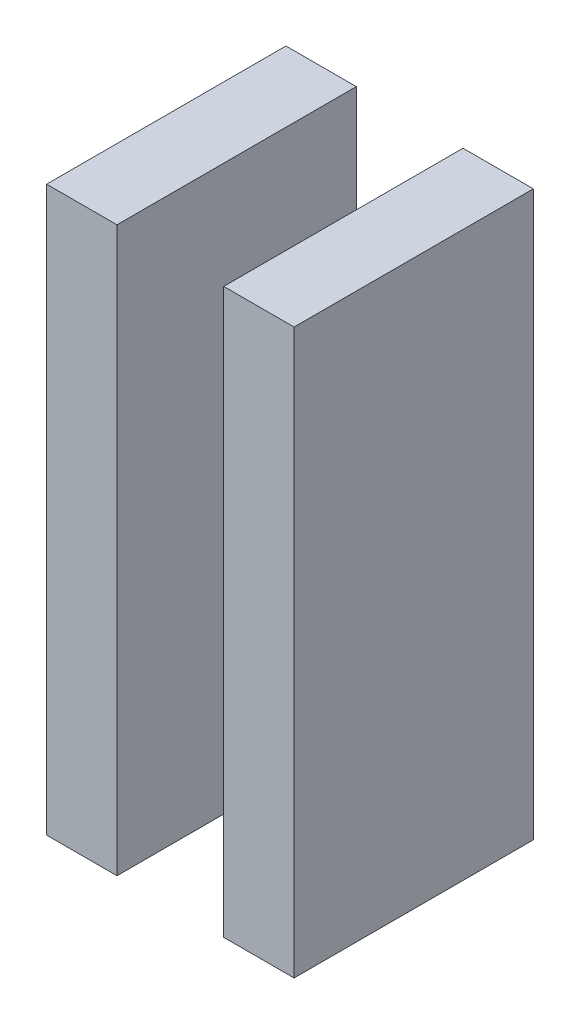
ISO-10303-21;
HEADER;
FILE_DESCRIPTION(('STEP AP214'),'2;1');
FILE_NAME('part.step','',(''),(''),'','','');
FILE_SCHEMA(('AUTOMOTIVE_DESIGN { 1 0 10303 214 1 1 1 1 }'));
ENDSEC;
DATA;
#1=APPLICATION_CONTEXT('core data for automotive mechanical design processes');
#2=APPLICATION_PROTOCOL_DEFINITION('international standard','automotive_design',2000,#1);
#3=PRODUCT_CONTEXT('',#1,'mechanical');
#4=PRODUCT('Part','Part','',(#3));
#5=PRODUCT_RELATED_PRODUCT_CATEGORY('part','',(#4));
#6=PRODUCT_DEFINITION_FORMATION('','',#4);
#7=PRODUCT_DEFINITION_CONTEXT('part definition',#1,'design');
#8=PRODUCT_DEFINITION('design','',#6,#7);
#9=PRODUCT_DEFINITION_SHAPE('','',#8);
#10=(LENGTH_UNIT() NAMED_UNIT(*) SI_UNIT(.MILLI.,.METRE.));
#11=(NAMED_UNIT(*) PLANE_ANGLE_UNIT() SI_UNIT($,.RADIAN.));
#12=(NAMED_UNIT(*) SI_UNIT($,.STERADIAN.) SOLID_ANGLE_UNIT());
#13=UNCERTAINTY_MEASURE_WITH_UNIT(LENGTH_MEASURE(1.E-05),#10,'distance_accuracy_value','');
#14=(GEOMETRIC_REPRESENTATION_CONTEXT(3) GLOBAL_UNCERTAINTY_ASSIGNED_CONTEXT((#13)) GLOBAL_UNIT_ASSIGNED_CONTEXT((#10,
#11,#12)) REPRESENTATION_CONTEXT('',''));
#15=CARTESIAN_POINT('',(0.,0.,0.));
#16=DIRECTION('',(0.,0.,1.));
#17=DIRECTION('',(1.,0.,0.));
#18=AXIS2_PLACEMENT_3D('',#15,#16,#17);
#19=CARTESIAN_POINT('',(158.1725,-54.445,11.));
#20=DIRECTION('',(0.,-1.,0.));
#21=DIRECTION('',(0.,0.,-1.));
#22=AXIS2_PLACEMENT_3D('',#19,#20,#21);
#23=PLANE('',#22);
#24=DIRECTION('',(-1.,0.,0.));
#25=VECTOR('',#24,1.);
#26=CARTESIAN_POINT('',(158.1725,-54.445,1.));
#27=LINE('',#26,#25);
#28=CARTESIAN_POINT('',(158.1725,-54.445,1.));
#29=VERTEX_POINT('',#28);
#30=CARTESIAN_POINT('',(155.2325,-54.445,1.));
#31=VERTEX_POINT('',#30);
#32=EDGE_CURVE('E12',#29,#31,#27,.T.);
#33=ORIENTED_EDGE('',*,*,#32,.T.);
#34=DIRECTION('',(0.,0.,-1.));
#35=VECTOR('',#34,1.);
#36=CARTESIAN_POINT('',(155.2325,-54.445,11.));
#37=LINE('',#36,#35);
#38=CARTESIAN_POINT('',(155.2325,-54.445,11.));
#39=VERTEX_POINT('',#38);
#40=EDGE_CURVE('E118',#39,#31,#37,.T.);
#41=ORIENTED_EDGE('',*,*,#40,.F.);
#42=DIRECTION('',(-1.,0.,0.));
#43=VECTOR('',#42,1.);
#44=CARTESIAN_POINT('',(158.1725,-54.445,11.));
#45=LINE('',#44,#43);
#46=CARTESIAN_POINT('',(158.1725,-54.445,11.));
#47=VERTEX_POINT('',#46);
#48=EDGE_CURVE('E51',#47,#39,#45,.T.);
#49=ORIENTED_EDGE('',*,*,#48,.F.);
#50=DIRECTION('',(0.,0.,-1.));
#51=VECTOR('',#50,1.);
#52=CARTESIAN_POINT('',(158.1725,-54.445,11.));
#53=LINE('',#52,#51);
#54=EDGE_CURVE('E106',#47,#29,#53,.T.);
#55=ORIENTED_EDGE('',*,*,#54,.T.);
#56=EDGE_LOOP('',(#33,#41,#49,#55));
#57=FACE_BOUND('',#56,.T.);
#58=ADVANCED_FACE('F47',(#57),#23,.F.);
#59=CARTESIAN_POINT('',(155.2325,-54.445,11.));
#60=DIRECTION('',(1.,0.,0.));
#61=DIRECTION('',(0.,0.,-1.));
#62=AXIS2_PLACEMENT_3D('',#59,#60,#61);
#63=PLANE('',#62);
#64=DIRECTION('',(0.,-1.,0.));
#65=VECTOR('',#64,1.);
#66=CARTESIAN_POINT('',(155.2325,-54.445,1.));
#67=LINE('',#66,#65);
#68=CARTESIAN_POINT('',(155.2325,-78.005,1.));
#69=VERTEX_POINT('',#68);
#70=EDGE_CURVE('E57',#31,#69,#67,.T.);
#71=ORIENTED_EDGE('',*,*,#70,.T.);
#72=DIRECTION('',(0.,0.,-1.));
#73=VECTOR('',#72,1.);
#74=CARTESIAN_POINT('',(155.2325,-78.005,11.));
#75=LINE('',#74,#73);
#76=CARTESIAN_POINT('',(155.2325,-78.005,11.));
#77=VERTEX_POINT('',#76);
#78=EDGE_CURVE('E102',#77,#69,#75,.T.);
#79=ORIENTED_EDGE('',*,*,#78,.F.);
#80=DIRECTION('',(0.,-1.,0.));
#81=VECTOR('',#80,1.);
#82=CARTESIAN_POINT('',(155.2325,-54.445,11.));
#83=LINE('',#82,#81);
#84=EDGE_CURVE('E81',#39,#77,#83,.T.);
#85=ORIENTED_EDGE('',*,*,#84,.F.);
#86=ORIENTED_EDGE('',*,*,#40,.T.);
#87=EDGE_LOOP('',(#71,#79,#85,#86));
#88=FACE_BOUND('',#87,.T.);
#89=ADVANCED_FACE('F121',(#88),#63,.F.);
#90=CARTESIAN_POINT('',(158.1725,-78.005,11.));
#91=DIRECTION('',(0.,1.,0.));
#92=DIRECTION('',(0.,0.,1.));
#93=AXIS2_PLACEMENT_3D('',#90,#91,#92);
#94=PLANE('',#93);
#95=DIRECTION('',(1.,0.,0.));
#96=VECTOR('',#95,1.);
#97=CARTESIAN_POINT('',(158.1725,-78.005,1.));
#98=LINE('',#97,#96);
#99=CARTESIAN_POINT('',(158.1725,-78.005,1.));
#100=VERTEX_POINT('',#99);
#101=EDGE_CURVE('E97',#69,#100,#98,.T.);
#102=ORIENTED_EDGE('',*,*,#101,.T.);
#103=DIRECTION('',(0.,0.,-1.));
#104=VECTOR('',#103,1.);
#105=CARTESIAN_POINT('',(158.1725,-78.005,11.));
#106=LINE('',#105,#104);
#107=CARTESIAN_POINT('',(158.1725,-78.005,11.));
#108=VERTEX_POINT('',#107);
#109=EDGE_CURVE('E100',#108,#100,#106,.T.);
#110=ORIENTED_EDGE('',*,*,#109,.F.);
#111=DIRECTION('',(1.,0.,0.));
#112=VECTOR('',#111,1.);
#113=CARTESIAN_POINT('',(158.1725,-78.005,11.));
#114=LINE('',#113,#112);
#115=EDGE_CURVE('E114',#77,#108,#114,.T.);
#116=ORIENTED_EDGE('',*,*,#115,.F.);
#117=ORIENTED_EDGE('',*,*,#78,.T.);
#118=EDGE_LOOP('',(#102,#110,#116,#117));
#119=FACE_BOUND('',#118,.T.);
#120=ADVANCED_FACE('F98',(#119),#94,.F.);
#121=CARTESIAN_POINT('',(158.1725,-54.445,11.));
#122=DIRECTION('',(-1.,0.,0.));
#123=DIRECTION('',(0.,0.,1.));
#124=AXIS2_PLACEMENT_3D('',#121,#122,#123);
#125=PLANE('',#124);
#126=DIRECTION('',(0.,1.,0.));
#127=VECTOR('',#126,1.);
#128=CARTESIAN_POINT('',(158.1725,-54.445,1.));
#129=LINE('',#128,#127);
#130=EDGE_CURVE('E91',#100,#29,#129,.T.);
#131=ORIENTED_EDGE('',*,*,#130,.T.);
#132=ORIENTED_EDGE('',*,*,#54,.F.);
#133=DIRECTION('',(0.,1.,0.));
#134=VECTOR('',#133,1.);
#135=CARTESIAN_POINT('',(158.1725,-54.445,11.));
#136=LINE('',#135,#134);
#137=EDGE_CURVE('E105',#108,#47,#136,.T.);
#138=ORIENTED_EDGE('',*,*,#137,.F.);
#139=ORIENTED_EDGE('',*,*,#109,.T.);
#140=EDGE_LOOP('',(#131,#132,#138,#139));
#141=FACE_BOUND('',#140,.T.);
#142=ADVANCED_FACE('F104',(#141),#125,.F.);
#143=CARTESIAN_POINT('',(0.,0.,11.));
#144=DIRECTION('',(0.,0.,1.));
#145=DIRECTION('',(1.,0.,0.));
#146=AXIS2_PLACEMENT_3D('',#143,#144,#145);
#147=PLANE('',#146);
#148=ORIENTED_EDGE('',*,*,#48,.T.);
#149=ORIENTED_EDGE('',*,*,#84,.T.);
#150=ORIENTED_EDGE('',*,*,#115,.T.);
#151=ORIENTED_EDGE('',*,*,#137,.T.);
#152=EDGE_LOOP('',(#148,#149,#150,#151));
#153=FACE_BOUND('',#152,.T.);
#154=ADVANCED_FACE('F49',(#153),#147,.T.);
#155=CARTESIAN_POINT('',(0.,0.,1.));
#156=DIRECTION('',(0.,0.,1.));
#157=DIRECTION('',(1.,0.,0.));
#158=AXIS2_PLACEMENT_3D('',#155,#156,#157);
#159=PLANE('',#158);
#160=ORIENTED_EDGE('',*,*,#32,.F.);
#161=ORIENTED_EDGE('',*,*,#130,.F.);
#162=ORIENTED_EDGE('',*,*,#101,.F.);
#163=ORIENTED_EDGE('',*,*,#70,.F.);
#164=EDGE_LOOP('',(#160,#161,#162,#163));
#165=FACE_BOUND('',#164,.T.);
#166=ADVANCED_FACE('F108',(#165),#159,.F.);
#167=CLOSED_SHELL('',(#58,#89,#120,#142,#154,#166));
#168=MANIFOLD_SOLID_BREP('B2',#167);
#169=CARTESIAN_POINT('',(147.8325,-54.445,11.));
#170=DIRECTION('',(1.,0.,0.));
#171=DIRECTION('',(0.,0.,-1.));
#172=AXIS2_PLACEMENT_3D('',#169,#170,#171);
#173=PLANE('',#172);
#174=DIRECTION('',(0.,-1.,0.));
#175=VECTOR('',#174,1.);
#176=CARTESIAN_POINT('',(147.8325,-54.445,1.));
#177=LINE('',#176,#175);
#178=CARTESIAN_POINT('',(147.8325,-54.445,1.));
#179=VERTEX_POINT('',#178);
#180=CARTESIAN_POINT('',(147.8325,-78.005,1.));
#181=VERTEX_POINT('',#180);
#182=EDGE_CURVE('E246',#179,#181,#177,.T.);
#183=ORIENTED_EDGE('',*,*,#182,.T.);
#184=DIRECTION('',(0.,0.,-1.));
#185=VECTOR('',#184,1.);
#186=CARTESIAN_POINT('',(147.8325,-78.005,11.));
#187=LINE('',#186,#185);
#188=CARTESIAN_POINT('',(147.8325,-78.005,11.));
#189=VERTEX_POINT('',#188);
#190=EDGE_CURVE('E45',#189,#181,#187,.T.);
#191=ORIENTED_EDGE('',*,*,#190,.F.);
#192=DIRECTION('',(0.,-1.,0.));
#193=VECTOR('',#192,1.);
#194=CARTESIAN_POINT('',(147.8325,-54.445,11.));
#195=LINE('',#194,#193);
#196=CARTESIAN_POINT('',(147.8325,-54.445,11.));
#197=VERTEX_POINT('',#196);
#198=EDGE_CURVE('E234',#197,#189,#195,.T.);
#199=ORIENTED_EDGE('',*,*,#198,.F.);
#200=DIRECTION('',(0.,0.,-1.));
#201=VECTOR('',#200,1.);
#202=CARTESIAN_POINT('',(147.8325,-54.445,11.));
#203=LINE('',#202,#201);
#204=EDGE_CURVE('E242',#197,#179,#203,.T.);
#205=ORIENTED_EDGE('',*,*,#204,.T.);
#206=EDGE_LOOP('',(#183,#191,#199,#205));
#207=FACE_BOUND('',#206,.T.);
#208=ADVANCED_FACE('F183',(#207),#173,.F.);
#209=CARTESIAN_POINT('',(147.8325,-78.005,11.));
#210=DIRECTION('',(0.,1.,0.));
#211=DIRECTION('',(0.,0.,1.));
#212=AXIS2_PLACEMENT_3D('',#209,#210,#211);
#213=PLANE('',#212);
#214=DIRECTION('',(1.,0.,0.));
#215=VECTOR('',#214,1.);
#216=CARTESIAN_POINT('',(147.8325,-78.005,1.));
#217=LINE('',#216,#215);
#218=CARTESIAN_POINT('',(150.7725,-78.005,1.));
#219=VERTEX_POINT('',#218);
#220=EDGE_CURVE('E238',#181,#219,#217,.T.);
#221=ORIENTED_EDGE('',*,*,#220,.T.);
#222=DIRECTION('',(0.,0.,-1.));
#223=VECTOR('',#222,1.);
#224=CARTESIAN_POINT('',(150.7725,-78.005,11.));
#225=LINE('',#224,#223);
#226=CARTESIAN_POINT('',(150.7725,-78.005,11.));
#227=VERTEX_POINT('',#226);
#228=EDGE_CURVE('E191',#227,#219,#225,.T.);
#229=ORIENTED_EDGE('',*,*,#228,.F.);
#230=DIRECTION('',(1.,0.,0.));
#231=VECTOR('',#230,1.);
#232=CARTESIAN_POINT('',(147.8325,-78.005,11.));
#233=LINE('',#232,#231);
#234=EDGE_CURVE('E229',#189,#227,#233,.T.);
#235=ORIENTED_EDGE('',*,*,#234,.F.);
#236=ORIENTED_EDGE('',*,*,#190,.T.);
#237=EDGE_LOOP('',(#221,#229,#235,#236));
#238=FACE_BOUND('',#237,.T.);
#239=ADVANCED_FACE('F237',(#238),#213,.F.);
#240=CARTESIAN_POINT('',(150.7725,-54.445,11.));
#241=DIRECTION('',(-1.,0.,0.));
#242=DIRECTION('',(0.,0.,1.));
#243=AXIS2_PLACEMENT_3D('',#240,#241,#242);
#244=PLANE('',#243);
#245=DIRECTION('',(0.,1.,0.));
#246=VECTOR('',#245,1.);
#247=CARTESIAN_POINT('',(150.7725,-54.445,1.));
#248=LINE('',#247,#246);
#249=CARTESIAN_POINT('',(150.7725,-54.445,1.));
#250=VERTEX_POINT('',#249);
#251=EDGE_CURVE('E216',#219,#250,#248,.T.);
#252=ORIENTED_EDGE('',*,*,#251,.T.);
#253=DIRECTION('',(0.,0.,-1.));
#254=VECTOR('',#253,1.);
#255=CARTESIAN_POINT('',(150.7725,-54.445,11.));
#256=LINE('',#255,#254);
#257=CARTESIAN_POINT('',(150.7725,-54.445,11.));
#258=VERTEX_POINT('',#257);
#259=EDGE_CURVE('E239',#258,#250,#256,.T.);
#260=ORIENTED_EDGE('',*,*,#259,.F.);
#261=DIRECTION('',(0.,1.,0.));
#262=VECTOR('',#261,1.);
#263=CARTESIAN_POINT('',(150.7725,-54.445,11.));
#264=LINE('',#263,#262);
#265=EDGE_CURVE('E232',#227,#258,#264,.T.);
#266=ORIENTED_EDGE('',*,*,#265,.F.);
#267=ORIENTED_EDGE('',*,*,#228,.T.);
#268=EDGE_LOOP('',(#252,#260,#266,#267));
#269=FACE_BOUND('',#268,.T.);
#270=ADVANCED_FACE('F240',(#269),#244,.F.);
#271=CARTESIAN_POINT('',(147.8325,-54.445,11.));
#272=DIRECTION('',(0.,-1.,0.));
#273=DIRECTION('',(0.,0.,-1.));
#274=AXIS2_PLACEMENT_3D('',#271,#272,#273);
#275=PLANE('',#274);
#276=DIRECTION('',(-1.,0.,0.));
#277=VECTOR('',#276,1.);
#278=CARTESIAN_POINT('',(147.8325,-54.445,1.));
#279=LINE('',#278,#277);
#280=EDGE_CURVE('E222',#250,#179,#279,.T.);
#281=ORIENTED_EDGE('',*,*,#280,.T.);
#282=ORIENTED_EDGE('',*,*,#204,.F.);
#283=DIRECTION('',(-1.,0.,0.));
#284=VECTOR('',#283,1.);
#285=CARTESIAN_POINT('',(147.8325,-54.445,11.));
#286=LINE('',#285,#284);
#287=EDGE_CURVE('E199',#258,#197,#286,.T.);
#288=ORIENTED_EDGE('',*,*,#287,.F.);
#289=ORIENTED_EDGE('',*,*,#259,.T.);
#290=EDGE_LOOP('',(#281,#282,#288,#289));
#291=FACE_BOUND('',#290,.T.);
#292=ADVANCED_FACE('F253',(#291),#275,.F.);
#293=CARTESIAN_POINT('',(0.,0.,11.));
#294=DIRECTION('',(0.,0.,1.));
#295=DIRECTION('',(1.,0.,0.));
#296=AXIS2_PLACEMENT_3D('',#293,#294,#295);
#297=PLANE('',#296);
#298=ORIENTED_EDGE('',*,*,#198,.T.);
#299=ORIENTED_EDGE('',*,*,#234,.T.);
#300=ORIENTED_EDGE('',*,*,#265,.T.);
#301=ORIENTED_EDGE('',*,*,#287,.T.);
#302=EDGE_LOOP('',(#298,#299,#300,#301));
#303=FACE_BOUND('',#302,.T.);
#304=ADVANCED_FACE('F230',(#303),#297,.T.);
#305=CARTESIAN_POINT('',(0.,0.,1.));
#306=DIRECTION('',(0.,0.,1.));
#307=DIRECTION('',(1.,0.,0.));
#308=AXIS2_PLACEMENT_3D('',#305,#306,#307);
#309=PLANE('',#308);
#310=ORIENTED_EDGE('',*,*,#182,.F.);
#311=ORIENTED_EDGE('',*,*,#280,.F.);
#312=ORIENTED_EDGE('',*,*,#251,.F.);
#313=ORIENTED_EDGE('',*,*,#220,.F.);
#314=EDGE_LOOP('',(#310,#311,#312,#313));
#315=FACE_BOUND('',#314,.T.);
#316=ADVANCED_FACE('F256',(#315),#309,.F.);
#317=CLOSED_SHELL('',(#208,#239,#270,#292,#304,#316));
#318=MANIFOLD_SOLID_BREP('B6',#317);
#319=ADVANCED_BREP_SHAPE_REPRESENTATION('',(#18,#168,#318),#14);
#320=SHAPE_DEFINITION_REPRESENTATION(#9,#319);
ENDSEC;
END-ISO-10303-21;
